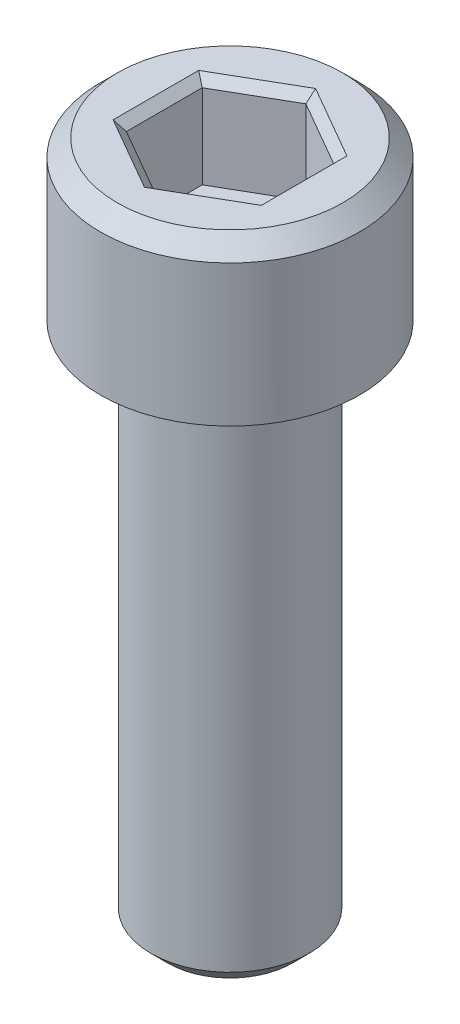
ISO-10303-21;
HEADER;
FILE_DESCRIPTION(('STEP AP214'),'2;1');
FILE_NAME('part.step','',(''),(''),'','','');
FILE_SCHEMA(('AUTOMOTIVE_DESIGN { 1 0 10303 214 1 1 1 1 }'));
ENDSEC;
DATA;
#1=APPLICATION_CONTEXT('core data for automotive mechanical design processes');
#2=APPLICATION_PROTOCOL_DEFINITION('international standard','automotive_design',2000,#1);
#3=PRODUCT_CONTEXT('',#1,'mechanical');
#4=PRODUCT('Part','Part','',(#3));
#5=PRODUCT_RELATED_PRODUCT_CATEGORY('part','',(#4));
#6=PRODUCT_DEFINITION_FORMATION('','',#4);
#7=PRODUCT_DEFINITION_CONTEXT('part definition',#1,'design');
#8=PRODUCT_DEFINITION('design','',#6,#7);
#9=PRODUCT_DEFINITION_SHAPE('','',#8);
#10=(LENGTH_UNIT() NAMED_UNIT(*) SI_UNIT(.MILLI.,.METRE.));
#11=(NAMED_UNIT(*) PLANE_ANGLE_UNIT() SI_UNIT($,.RADIAN.));
#12=(NAMED_UNIT(*) SI_UNIT($,.STERADIAN.) SOLID_ANGLE_UNIT());
#13=UNCERTAINTY_MEASURE_WITH_UNIT(LENGTH_MEASURE(1.E-05),#10,'distance_accuracy_value','');
#14=(GEOMETRIC_REPRESENTATION_CONTEXT(3) GLOBAL_UNCERTAINTY_ASSIGNED_CONTEXT((#13)) GLOBAL_UNIT_ASSIGNED_CONTEXT((#10,
#11,#12)) REPRESENTATION_CONTEXT('',''));
#15=CARTESIAN_POINT('',(0.,0.,0.));
#16=DIRECTION('',(0.,0.,1.));
#17=DIRECTION('',(1.,0.,0.));
#18=AXIS2_PLACEMENT_3D('',#15,#16,#17);
#19=CARTESIAN_POINT('',(-3.96874999999999,-2.79399999999996,0.));
#20=DIRECTION('',(0.,-1.,0.));
#21=DIRECTION('',(0.,0.,-1.));
#22=AXIS2_PLACEMENT_3D('',#19,#20,#21);
#23=PLANE('',#22);
#24=DIRECTION('',(-0.866025403784439,0.,0.5));
#25=VECTOR('',#24,1.);
#26=CARTESIAN_POINT('',(1.98437500000001,-2.79399999999996,1.14567944042317));
#27=LINE('',#26,#25);
#28=CARTESIAN_POINT('',(1.98437500000001,-2.79399999999996,1.14567944042317));
#29=VERTEX_POINT('',#28);
#30=CARTESIAN_POINT('',(0.,-2.79399999999996,2.29135888084634));
#31=VERTEX_POINT('',#30);
#32=EDGE_CURVE('E83',#29,#31,#27,.T.);
#33=ORIENTED_EDGE('',*,*,#32,.F.);
#34=DIRECTION('',(0.,0.,1.));
#35=VECTOR('',#34,1.);
#36=CARTESIAN_POINT('',(1.98437500000001,-2.79399999999996,-1.14567944042316));
#37=LINE('',#36,#35);
#38=CARTESIAN_POINT('',(1.98437500000001,-2.79399999999996,-1.14567944042316));
#39=VERTEX_POINT('',#38);
#40=EDGE_CURVE('E88',#39,#29,#37,.T.);
#41=ORIENTED_EDGE('',*,*,#40,.F.);
#42=DIRECTION('',(0.866025403784439,0.,0.5));
#43=VECTOR('',#42,1.);
#44=CARTESIAN_POINT('',(0.,-2.79399999999996,-2.29135888084632));
#45=LINE('',#44,#43);
#46=CARTESIAN_POINT('',(0.,-2.79399999999996,-2.29135888084632));
#47=VERTEX_POINT('',#46);
#48=EDGE_CURVE('E169',#47,#39,#45,.T.);
#49=ORIENTED_EDGE('',*,*,#48,.F.);
#50=DIRECTION('',(0.866025403784438,0.,-0.500000000000001));
#51=VECTOR('',#50,1.);
#52=CARTESIAN_POINT('',(-1.984375,-2.79399999999996,-1.14567944042316));
#53=LINE('',#52,#51);
#54=CARTESIAN_POINT('',(-1.984375,-2.79399999999996,-1.14567944042316));
#55=VERTEX_POINT('',#54);
#56=EDGE_CURVE('E175',#55,#47,#53,.T.);
#57=ORIENTED_EDGE('',*,*,#56,.F.);
#58=DIRECTION('',(0.,0.,-1.));
#59=VECTOR('',#58,1.);
#60=CARTESIAN_POINT('',(-1.984375,-2.79399999999996,1.14567944042317));
#61=LINE('',#60,#59);
#62=CARTESIAN_POINT('',(-1.984375,-2.79399999999996,1.14567944042317));
#63=VERTEX_POINT('',#62);
#64=EDGE_CURVE('E180',#63,#55,#61,.T.);
#65=ORIENTED_EDGE('',*,*,#64,.F.);
#66=DIRECTION('',(-0.866025403784438,0.,-0.5));
#67=VECTOR('',#66,1.);
#68=CARTESIAN_POINT('',(0.,-2.79399999999996,2.29135888084634));
#69=LINE('',#68,#67);
#70=EDGE_CURVE('E99',#31,#63,#69,.T.);
#71=ORIENTED_EDGE('',*,*,#70,.F.);
#72=EDGE_LOOP('',(#33,#41,#49,#57,#65,#71));
#73=FACE_BOUND('',#72,.T.);
#74=ADVANCED_FACE('F14',(#73),#23,.F.);
#75=CARTESIAN_POINT('',(1.98437500000001,-2.79399999999996,-1.14567944042316));
#76=DIRECTION('',(-1.,0.,0.));
#77=DIRECTION('',(0.,0.,1.));
#78=AXIS2_PLACEMENT_3D('',#75,#76,#77);
#79=PLANE('',#78);
#80=DIRECTION('',(0.,1.,0.));
#81=VECTOR('',#80,1.);
#82=CARTESIAN_POINT('',(1.98437500000001,-2.79399999999996,-1.14567944042315));
#83=LINE('',#82,#81);
#84=CARTESIAN_POINT('',(1.98437500000001,-0.25399999999998,-1.14567944042316));
#85=VERTEX_POINT('',#84);
#86=EDGE_CURVE('E93',#39,#85,#83,.T.);
#87=ORIENTED_EDGE('',*,*,#86,.F.);
#88=ORIENTED_EDGE('',*,*,#40,.T.);
#89=DIRECTION('',(0.,1.,0.));
#90=VECTOR('',#89,1.);
#91=CARTESIAN_POINT('',(1.98437500000001,-2.79399999999996,1.14567944042317));
#92=LINE('',#91,#90);
#93=CARTESIAN_POINT('',(1.98437500000001,-0.253999999999979,1.14567944042318));
#94=VERTEX_POINT('',#93);
#95=EDGE_CURVE('E90',#94,#29,#92,.F.);
#96=ORIENTED_EDGE('',*,*,#95,.F.);
#97=DIRECTION('',(0.,0.,1.));
#98=VECTOR('',#97,1.);
#99=CARTESIAN_POINT('',(1.98437500000002,-0.253999999999987,0.));
#100=LINE('',#99,#98);
#101=EDGE_CURVE('E167',#94,#85,#100,.F.);
#102=ORIENTED_EDGE('',*,*,#101,.T.);
#103=EDGE_LOOP('',(#87,#88,#96,#102));
#104=FACE_BOUND('',#103,.T.);
#105=ADVANCED_FACE('F89',(#104),#79,.T.);
#106=CARTESIAN_POINT('',(1.98437500000001,-2.79399999999996,1.14567944042317));
#107=DIRECTION('',(-0.5,0.,-0.866025403784439));
#108=DIRECTION('',(-0.866025403784439,0.,0.5));
#109=AXIS2_PLACEMENT_3D('',#106,#107,#108);
#110=PLANE('',#109);
#111=ORIENTED_EDGE('',*,*,#95,.T.);
#112=ORIENTED_EDGE('',*,*,#32,.T.);
#113=DIRECTION('',(0.,1.,0.));
#114=VECTOR('',#113,1.);
#115=CARTESIAN_POINT('',(0.,-2.79399999999996,2.29135888084634));
#116=LINE('',#115,#114);
#117=CARTESIAN_POINT('',(0.,-0.253999999999979,2.29135888084634));
#118=VERTEX_POINT('',#117);
#119=EDGE_CURVE('E101',#118,#31,#116,.F.);
#120=ORIENTED_EDGE('',*,*,#119,.F.);
#121=DIRECTION('',(0.866025403784439,0.,-0.5));
#122=VECTOR('',#121,1.);
#123=CARTESIAN_POINT('',(0.,-0.253999999999987,2.29135888084635));
#124=LINE('',#123,#122);
#125=EDGE_CURVE('E105',#118,#94,#124,.T.);
#126=ORIENTED_EDGE('',*,*,#125,.T.);
#127=EDGE_LOOP('',(#111,#112,#120,#126));
#128=FACE_BOUND('',#127,.T.);
#129=ADVANCED_FACE('F103',(#128),#110,.T.);
#130=CARTESIAN_POINT('',(0.,-2.79399999999996,2.29135888084634));
#131=DIRECTION('',(0.5,0.,-0.866025403784438));
#132=DIRECTION('',(-0.866025403784438,0.,-0.5));
#133=AXIS2_PLACEMENT_3D('',#130,#131,#132);
#134=PLANE('',#133);
#135=ORIENTED_EDGE('',*,*,#119,.T.);
#136=ORIENTED_EDGE('',*,*,#70,.T.);
#137=DIRECTION('',(0.,1.,0.));
#138=VECTOR('',#137,1.);
#139=CARTESIAN_POINT('',(-1.984375,-2.79399999999996,1.14567944042317));
#140=LINE('',#139,#138);
#141=CARTESIAN_POINT('',(-1.984375,-0.253999999999979,1.14567944042317));
#142=VERTEX_POINT('',#141);
#143=EDGE_CURVE('E182',#142,#63,#140,.F.);
#144=ORIENTED_EDGE('',*,*,#143,.F.);
#145=DIRECTION('',(0.866025403784438,0.,0.5));
#146=VECTOR('',#145,1.);
#147=CARTESIAN_POINT('',(-1.984375,-0.253999999999986,1.14567944042318));
#148=LINE('',#147,#146);
#149=EDGE_CURVE('E161',#142,#118,#148,.T.);
#150=ORIENTED_EDGE('',*,*,#149,.T.);
#151=EDGE_LOOP('',(#135,#136,#144,#150));
#152=FACE_BOUND('',#151,.T.);
#153=ADVANCED_FACE('F186',(#152),#134,.T.);
#154=CARTESIAN_POINT('',(-1.984375,-2.79399999999996,1.14567944042317));
#155=DIRECTION('',(1.,0.,0.));
#156=DIRECTION('',(0.,0.,-1.));
#157=AXIS2_PLACEMENT_3D('',#154,#155,#156);
#158=PLANE('',#157);
#159=ORIENTED_EDGE('',*,*,#143,.T.);
#160=ORIENTED_EDGE('',*,*,#64,.T.);
#161=DIRECTION('',(0.,1.,0.));
#162=VECTOR('',#161,1.);
#163=CARTESIAN_POINT('',(-1.984375,-2.79399999999996,-1.14567944042316));
#164=LINE('',#163,#162);
#165=CARTESIAN_POINT('',(-1.984375,-0.253999999999979,-1.14567944042316));
#166=VERTEX_POINT('',#165);
#167=EDGE_CURVE('E177',#166,#55,#164,.F.);
#168=ORIENTED_EDGE('',*,*,#167,.F.);
#169=DIRECTION('',(0.,0.,1.));
#170=VECTOR('',#169,1.);
#171=CARTESIAN_POINT('',(-1.98437500000001,-0.253999999999987,0.));
#172=LINE('',#171,#170);
#173=EDGE_CURVE('E156',#166,#142,#172,.T.);
#174=ORIENTED_EDGE('',*,*,#173,.T.);
#175=EDGE_LOOP('',(#159,#160,#168,#174));
#176=FACE_BOUND('',#175,.T.);
#177=ADVANCED_FACE('F216',(#176),#158,.T.);
#178=CARTESIAN_POINT('',(-1.984375,-2.79399999999996,-1.14567944042316));
#179=DIRECTION('',(0.500000000000001,0.,0.866025403784438));
#180=DIRECTION('',(0.866025403784438,0.,-0.500000000000001));
#181=AXIS2_PLACEMENT_3D('',#178,#179,#180);
#182=PLANE('',#181);
#183=ORIENTED_EDGE('',*,*,#167,.T.);
#184=ORIENTED_EDGE('',*,*,#56,.T.);
#185=DIRECTION('',(0.,1.,0.));
#186=VECTOR('',#185,1.);
#187=CARTESIAN_POINT('',(0.,-2.79399999999996,-2.29135888084632));
#188=LINE('',#187,#186);
#189=CARTESIAN_POINT('',(0.,-0.253999999999979,-2.29135888084633));
#190=VERTEX_POINT('',#189);
#191=EDGE_CURVE('E171',#190,#47,#188,.F.);
#192=ORIENTED_EDGE('',*,*,#191,.F.);
#193=DIRECTION('',(-0.866025403784439,0.,0.499999999999999));
#194=VECTOR('',#193,1.);
#195=CARTESIAN_POINT('',(0.,-0.25399999999999,-2.29135888084633));
#196=LINE('',#195,#194);
#197=EDGE_CURVE('E151',#190,#166,#196,.T.);
#198=ORIENTED_EDGE('',*,*,#197,.T.);
#199=EDGE_LOOP('',(#183,#184,#192,#198));
#200=FACE_BOUND('',#199,.T.);
#201=ADVANCED_FACE('F212',(#200),#182,.T.);
#202=CARTESIAN_POINT('',(0.,-2.79399999999996,-2.29135888084632));
#203=DIRECTION('',(-0.5,0.,0.866025403784439));
#204=DIRECTION('',(0.866025403784439,0.,0.5));
#205=AXIS2_PLACEMENT_3D('',#202,#203,#204);
#206=PLANE('',#205);
#207=ORIENTED_EDGE('',*,*,#191,.T.);
#208=ORIENTED_EDGE('',*,*,#48,.T.);
#209=ORIENTED_EDGE('',*,*,#86,.T.);
#210=DIRECTION('',(-0.866025403784439,0.,-0.499999999999999));
#211=VECTOR('',#210,1.);
#212=CARTESIAN_POINT('',(1.98437500000001,-0.253999999999985,-1.14567944042317));
#213=LINE('',#212,#211);
#214=EDGE_CURVE('E143',#85,#190,#213,.T.);
#215=ORIENTED_EDGE('',*,*,#214,.T.);
#216=EDGE_LOOP('',(#207,#208,#209,#215));
#217=FACE_BOUND('',#216,.T.);
#218=ADVANCED_FACE('F207',(#217),#206,.T.);
#219=CARTESIAN_POINT('',(2.23837500000001,0.,0.));
#220=DIRECTION('',(0.707106781186548,-0.707106781186548,0.));
#221=DIRECTION('',(0.707106781186548,0.707106781186548,0.));
#222=AXIS2_PLACEMENT_3D('',#219,#220,#221);
#223=PLANE('',#222);
#224=ORIENTED_EDGE('',*,*,#101,.F.);
#225=DIRECTION('',(0.654653670707993,0.654653670707971,0.377964473009212));
#226=VECTOR('',#225,1.);
#227=CARTESIAN_POINT('',(1.98437500000002,-0.253999999999987,1.14567944042318));
#228=LINE('',#227,#226);
#229=CARTESIAN_POINT('',(2.23837500000001,0.,1.29232640879733));
#230=VERTEX_POINT('',#229);
#231=EDGE_CURVE('E164',#94,#230,#228,.T.);
#232=ORIENTED_EDGE('',*,*,#231,.T.);
#233=DIRECTION('',(0.,0.,1.));
#234=VECTOR('',#233,1.);
#235=CARTESIAN_POINT('',(2.23837500000001,0.,0.));
#236=LINE('',#235,#234);
#237=CARTESIAN_POINT('',(2.23837500000001,0.,-1.29232640879732));
#238=VERTEX_POINT('',#237);
#239=EDGE_CURVE('E139',#238,#230,#236,.T.);
#240=ORIENTED_EDGE('',*,*,#239,.F.);
#241=DIRECTION('',(-0.654653670707993,-0.65465367070797,0.377964473009211));
#242=VECTOR('',#241,1.);
#243=CARTESIAN_POINT('',(2.23837500000001,0.,-1.29232640879732));
#244=LINE('',#243,#242);
#245=EDGE_CURVE('E146',#238,#85,#244,.T.);
#246=ORIENTED_EDGE('',*,*,#245,.T.);
#247=EDGE_LOOP('',(#224,#232,#240,#246));
#248=FACE_BOUND('',#247,.T.);
#249=ADVANCED_FACE('F202',(#248),#223,.F.);
#250=CARTESIAN_POINT('',(1.11918750000001,0.,1.938489613196));
#251=DIRECTION('',(0.353553390593273,-0.707106781186548,0.612372435695794));
#252=DIRECTION('',(0.,-0.654653670707977,-0.755928946018455));
#253=AXIS2_PLACEMENT_3D('',#250,#251,#252);
#254=PLANE('',#253);
#255=ORIENTED_EDGE('',*,*,#125,.F.);
#256=DIRECTION('',(0.,-0.654653670707977,-0.755928946018455));
#257=VECTOR('',#256,1.);
#258=CARTESIAN_POINT('',(0.,-0.319767857142858,2.21541670079542));
#259=LINE('',#258,#257);
#260=CARTESIAN_POINT('',(0.,0.,2.58465281759466));
#261=VERTEX_POINT('',#260);
#262=EDGE_CURVE('E159',#118,#261,#259,.F.);
#263=ORIENTED_EDGE('',*,*,#262,.T.);
#264=DIRECTION('',(-0.866025403784438,0.,0.500000000000001));
#265=VECTOR('',#264,1.);
#266=CARTESIAN_POINT('',(2.23837500000001,0.,1.29232640879733));
#267=LINE('',#266,#265);
#268=EDGE_CURVE('E136',#230,#261,#267,.T.);
#269=ORIENTED_EDGE('',*,*,#268,.F.);
#270=ORIENTED_EDGE('',*,*,#231,.F.);
#271=EDGE_LOOP('',(#255,#263,#269,#270));
#272=FACE_BOUND('',#271,.T.);
#273=ADVANCED_FACE('F193',(#272),#254,.F.);
#274=CARTESIAN_POINT('',(-1.1191875,0.,1.938489613196));
#275=DIRECTION('',(-0.353553390593274,-0.707106781186548,0.612372435695794));
#276=DIRECTION('',(0.,-0.654653670707977,-0.755928946018455));
#277=AXIS2_PLACEMENT_3D('',#274,#275,#276);
#278=PLANE('',#277);
#279=DIRECTION('',(-0.866025403784438,0.,-0.500000000000001));
#280=VECTOR('',#279,1.);
#281=CARTESIAN_POINT('',(0.,0.,2.58465281759467));
#282=LINE('',#281,#280);
#283=CARTESIAN_POINT('',(-2.23837499999999,0.,1.29232640879733));
#284=VERTEX_POINT('',#283);
#285=EDGE_CURVE('E133',#261,#284,#282,.T.);
#286=ORIENTED_EDGE('',*,*,#285,.F.);
#287=ORIENTED_EDGE('',*,*,#262,.F.);
#288=ORIENTED_EDGE('',*,*,#149,.F.);
#289=DIRECTION('',(-0.654653670707976,0.654653670707976,0.377964473009231));
#290=VECTOR('',#289,1.);
#291=CARTESIAN_POINT('',(-1.98437500000001,-0.253999999999987,1.14567944042317));
#292=LINE('',#291,#290);
#293=EDGE_CURVE('E154',#142,#284,#292,.T.);
#294=ORIENTED_EDGE('',*,*,#293,.T.);
#295=EDGE_LOOP('',(#286,#287,#288,#294));
#296=FACE_BOUND('',#295,.T.);
#297=ADVANCED_FACE('F196',(#296),#278,.F.);
#298=CARTESIAN_POINT('',(-2.23837499999999,0.,0.));
#299=DIRECTION('',(-0.707106781186548,-0.707106781186548,0.));
#300=DIRECTION('',(0.707106781186548,-0.707106781186548,0.));
#301=AXIS2_PLACEMENT_3D('',#298,#299,#300);
#302=PLANE('',#301);
#303=DIRECTION('',(0.,0.,1.));
#304=VECTOR('',#303,1.);
#305=CARTESIAN_POINT('',(-2.23837499999999,0.,0.));
#306=LINE('',#305,#304);
#307=CARTESIAN_POINT('',(-2.23837499999999,0.,-1.29232640879732));
#308=VERTEX_POINT('',#307);
#309=EDGE_CURVE('E130',#284,#308,#306,.F.);
#310=ORIENTED_EDGE('',*,*,#309,.F.);
#311=ORIENTED_EDGE('',*,*,#293,.F.);
#312=ORIENTED_EDGE('',*,*,#173,.F.);
#313=DIRECTION('',(-0.654653670707992,0.654653670707971,-0.377964473009212));
#314=VECTOR('',#313,1.);
#315=CARTESIAN_POINT('',(-1.984375,-0.253999999999987,-1.14567944042317));
#316=LINE('',#315,#314);
#317=EDGE_CURVE('E149',#166,#308,#316,.T.);
#318=ORIENTED_EDGE('',*,*,#317,.T.);
#319=EDGE_LOOP('',(#310,#311,#312,#318));
#320=FACE_BOUND('',#319,.T.);
#321=ADVANCED_FACE('F214',(#320),#302,.F.);
#322=CARTESIAN_POINT('',(-1.11918749999999,0.,-1.93848961319599));
#323=DIRECTION('',(-0.353553390593274,-0.707106781186548,-0.612372435695794));
#324=DIRECTION('',(0.,0.654653670707977,-0.755928946018455));
#325=AXIS2_PLACEMENT_3D('',#322,#323,#324);
#326=PLANE('',#325);
#327=ORIENTED_EDGE('',*,*,#197,.F.);
#328=DIRECTION('',(0.,0.654653670707977,-0.755928946018455));
#329=VECTOR('',#328,1.);
#330=CARTESIAN_POINT('',(0.,-0.319767857142854,-2.21541670079541));
#331=LINE('',#330,#329);
#332=CARTESIAN_POINT('',(0.,0.,-2.58465281759465));
#333=VERTEX_POINT('',#332);
#334=EDGE_CURVE('E32',#190,#333,#331,.T.);
#335=ORIENTED_EDGE('',*,*,#334,.T.);
#336=DIRECTION('',(0.866025403784438,0.,-0.500000000000001));
#337=VECTOR('',#336,1.);
#338=CARTESIAN_POINT('',(-2.23837499999999,0.,-1.29232640879732));
#339=LINE('',#338,#337);
#340=EDGE_CURVE('E127',#308,#333,#339,.T.);
#341=ORIENTED_EDGE('',*,*,#340,.F.);
#342=ORIENTED_EDGE('',*,*,#317,.F.);
#343=EDGE_LOOP('',(#327,#335,#341,#342));
#344=FACE_BOUND('',#343,.T.);
#345=ADVANCED_FACE('F209',(#344),#326,.F.);
#346=CARTESIAN_POINT('',(1.1191875,0.,-1.93848961319599));
#347=DIRECTION('',(0.353553390593274,-0.707106781186548,-0.612372435695794));
#348=DIRECTION('',(0.,0.654653670707977,-0.755928946018455));
#349=AXIS2_PLACEMENT_3D('',#346,#347,#348);
#350=PLANE('',#349);
#351=ORIENTED_EDGE('',*,*,#214,.F.);
#352=ORIENTED_EDGE('',*,*,#245,.F.);
#353=DIRECTION('',(0.866025403784438,0.,0.500000000000001));
#354=VECTOR('',#353,1.);
#355=CARTESIAN_POINT('',(0.,0.,-2.58465281759465));
#356=LINE('',#355,#354);
#357=EDGE_CURVE('E122',#333,#238,#356,.T.);
#358=ORIENTED_EDGE('',*,*,#357,.F.);
#359=ORIENTED_EDGE('',*,*,#334,.F.);
#360=EDGE_LOOP('',(#351,#352,#358,#359));
#361=FACE_BOUND('',#360,.T.);
#362=ADVANCED_FACE('F205',(#361),#350,.F.);
#363=CARTESIAN_POINT('',(0.,0.,0.));
#364=DIRECTION('',(0.,1.,0.));
#365=DIRECTION('',(0.,0.,1.));
#366=AXIS2_PLACEMENT_3D('',#363,#364,#365);
#367=PLANE('',#366);
#368=CARTESIAN_POINT('',(0.,-5.6843418860808E-11,0.));
#369=DIRECTION('',(0.,-1.,0.));
#370=DIRECTION('',(0.,0.,-1.));
#371=AXIS2_PLACEMENT_3D('',#368,#369,#370);
#372=CIRCLE('',#371,3.40360000001283);
#373=CARTESIAN_POINT('',(0.,-5.6843418860808E-11,-3.40360000001283));
#374=VERTEX_POINT('',#373);
#375=EDGE_CURVE('E17',#374,#374,#372,.T.);
#376=ORIENTED_EDGE('',*,*,#375,.F.);
#377=EDGE_LOOP('',(#376));
#378=FACE_BOUND('',#377,.T.);
#379=ORIENTED_EDGE('',*,*,#340,.T.);
#380=ORIENTED_EDGE('',*,*,#357,.T.);
#381=ORIENTED_EDGE('',*,*,#239,.T.);
#382=ORIENTED_EDGE('',*,*,#268,.T.);
#383=ORIENTED_EDGE('',*,*,#285,.T.);
#384=ORIENTED_EDGE('',*,*,#309,.T.);
#385=EDGE_LOOP('',(#379,#380,#381,#382,#383,#384));
#386=FACE_BOUND('',#385,.T.);
#387=ADVANCED_FACE('F199',(#378,#386),#367,.T.);
#388=CARTESIAN_POINT('',(0.,-0.507999999911135,0.));
#389=DIRECTION('',(0.,-1.,0.));
#390=DIRECTION('',(0.,0.,-1.));
#391=AXIS2_PLACEMENT_3D('',#388,#389,#390);
#392=CONICAL_SURFACE('',#391,3.91159999986712,0.785398163397448);
#393=CARTESIAN_POINT('',(0.,-0.507999999999953,0.));
#394=DIRECTION('',(0.,1.,0.));
#395=DIRECTION('',(0.,0.,1.));
#396=AXIS2_PLACEMENT_3D('',#393,#394,#395);
#397=CIRCLE('',#396,3.9116);
#398=CARTESIAN_POINT('',(0.,-0.507999999999953,3.9116));
#399=VERTEX_POINT('',#398);
#400=EDGE_CURVE('E114',#399,#399,#397,.F.);
#401=ORIENTED_EDGE('',*,*,#400,.F.);
#402=EDGE_LOOP('',(#401));
#403=FACE_BOUND('',#402,.T.);
#404=ORIENTED_EDGE('',*,*,#375,.T.);
#405=EDGE_LOOP('',(#404));
#406=FACE_BOUND('',#405,.T.);
#407=ADVANCED_FACE('F249',(#403,#406),#392,.T.);
#408=CARTESIAN_POINT('',(0.,-20.6502,0.));
#409=DIRECTION('',(0.,1.,0.));
#410=DIRECTION('',(0.,0.,1.));
#411=AXIS2_PLACEMENT_3D('',#408,#409,#410);
#412=PLANE('',#411);
#413=CARTESIAN_POINT('',(0.,-20.6502000000341,0.));
#414=DIRECTION('',(0.,1.,0.));
#415=DIRECTION('',(0.,0.,1.));
#416=AXIS2_PLACEMENT_3D('',#413,#414,#415);
#417=CIRCLE('',#416,1.87959999993836);
#418=CARTESIAN_POINT('',(0.,-20.6502000000341,1.87959999993836));
#419=VERTEX_POINT('',#418);
#420=EDGE_CURVE('E112',#419,#419,#417,.T.);
#421=ORIENTED_EDGE('',*,*,#420,.F.);
#422=EDGE_LOOP('',(#421));
#423=FACE_BOUND('',#422,.T.);
#424=ADVANCED_FACE('F246',(#423),#412,.F.);
#425=CARTESIAN_POINT('',(0.,-4.77520000000009,0.));
#426=DIRECTION('',(0.,1.,0.));
#427=DIRECTION('',(0.,0.,1.));
#428=AXIS2_PLACEMENT_3D('',#425,#426,#427);
#429=CYLINDRICAL_SURFACE('',#428,3.9116);
#430=ORIENTED_EDGE('',*,*,#400,.T.);
#431=EDGE_LOOP('',(#430));
#432=FACE_BOUND('',#431,.T.);
#433=CARTESIAN_POINT('',(0.,-4.77520000000009,0.));
#434=DIRECTION('',(0.,1.,0.));
#435=DIRECTION('',(0.,0.,1.));
#436=AXIS2_PLACEMENT_3D('',#433,#434,#435);
#437=CIRCLE('',#436,3.9116);
#438=CARTESIAN_POINT('',(0.,-4.77520000000009,3.9116));
#439=VERTEX_POINT('',#438);
#440=EDGE_CURVE('E110',#439,#439,#437,.T.);
#441=ORIENTED_EDGE('',*,*,#440,.T.);
#442=EDGE_LOOP('',(#441));
#443=FACE_BOUND('',#442,.T.);
#444=ADVANCED_FACE('F242',(#432,#443),#429,.T.);
#445=CARTESIAN_POINT('',(0.,-20.1421999998956,0.));
#446=DIRECTION('',(0.,1.,0.));
#447=DIRECTION('',(0.,0.,1.));
#448=AXIS2_PLACEMENT_3D('',#445,#446,#447);
#449=CONICAL_SURFACE('',#448,2.38760000007687,0.785398163397448);
#450=CARTESIAN_POINT('',(0.,-20.1422,0.));
#451=DIRECTION('',(0.,1.,0.));
#452=DIRECTION('',(0.,0.,1.));
#453=AXIS2_PLACEMENT_3D('',#450,#451,#452);
#454=CIRCLE('',#453,2.3876);
#455=CARTESIAN_POINT('',(0.,-20.1422,2.3876));
#456=VERTEX_POINT('',#455);
#457=EDGE_CURVE('E23',#456,#456,#454,.T.);
#458=ORIENTED_EDGE('',*,*,#457,.F.);
#459=EDGE_LOOP('',(#458));
#460=FACE_BOUND('',#459,.T.);
#461=ORIENTED_EDGE('',*,*,#420,.T.);
#462=EDGE_LOOP('',(#461));
#463=FACE_BOUND('',#462,.T.);
#464=ADVANCED_FACE('F235',(#460,#463),#449,.T.);
#465=CARTESIAN_POINT('',(0.,-4.77520000000009,0.));
#466=DIRECTION('',(0.,1.,0.));
#467=DIRECTION('',(0.,0.,1.));
#468=AXIS2_PLACEMENT_3D('',#465,#466,#467);
#469=PLANE('',#468);
#470=ORIENTED_EDGE('',*,*,#440,.F.);
#471=EDGE_LOOP('',(#470));
#472=FACE_BOUND('',#471,.T.);
#473=CARTESIAN_POINT('',(0.,-4.77520000000009,0.));
#474=DIRECTION('',(0.,1.,0.));
#475=DIRECTION('',(0.,0.,1.));
#476=AXIS2_PLACEMENT_3D('',#473,#474,#475);
#477=CIRCLE('',#476,2.3876);
#478=CARTESIAN_POINT('',(0.,-4.77520000000009,2.3876));
#479=VERTEX_POINT('',#478);
#480=EDGE_CURVE('E9',#479,#479,#477,.F.);
#481=ORIENTED_EDGE('',*,*,#480,.F.);
#482=EDGE_LOOP('',(#481));
#483=FACE_BOUND('',#482,.T.);
#484=ADVANCED_FACE('F229',(#472,#483),#469,.F.);
#485=CARTESIAN_POINT('',(0.,-20.6502,0.));
#486=DIRECTION('',(0.,1.,0.));
#487=DIRECTION('',(0.,0.,1.));
#488=AXIS2_PLACEMENT_3D('',#485,#486,#487);
#489=CYLINDRICAL_SURFACE('',#488,2.3876);
#490=ORIENTED_EDGE('',*,*,#480,.T.);
#491=EDGE_LOOP('',(#490));
#492=FACE_BOUND('',#491,.T.);
#493=ORIENTED_EDGE('',*,*,#457,.T.);
#494=EDGE_LOOP('',(#493));
#495=FACE_BOUND('',#494,.T.);
#496=ADVANCED_FACE('F227',(#492,#495),#489,.T.);
#497=CLOSED_SHELL('',(#74,#105,#129,#153,#177,#201,#218,#249,#273,#297,#321,#345,#362,#387,#407,
#424,#444,#464,#484,#496));
#498=MANIFOLD_SOLID_BREP('B1',#497);
#499=ADVANCED_BREP_SHAPE_REPRESENTATION('',(#18,#498),#14);
#500=SHAPE_DEFINITION_REPRESENTATION(#9,#499);
ENDSEC;
END-ISO-10303-21;
